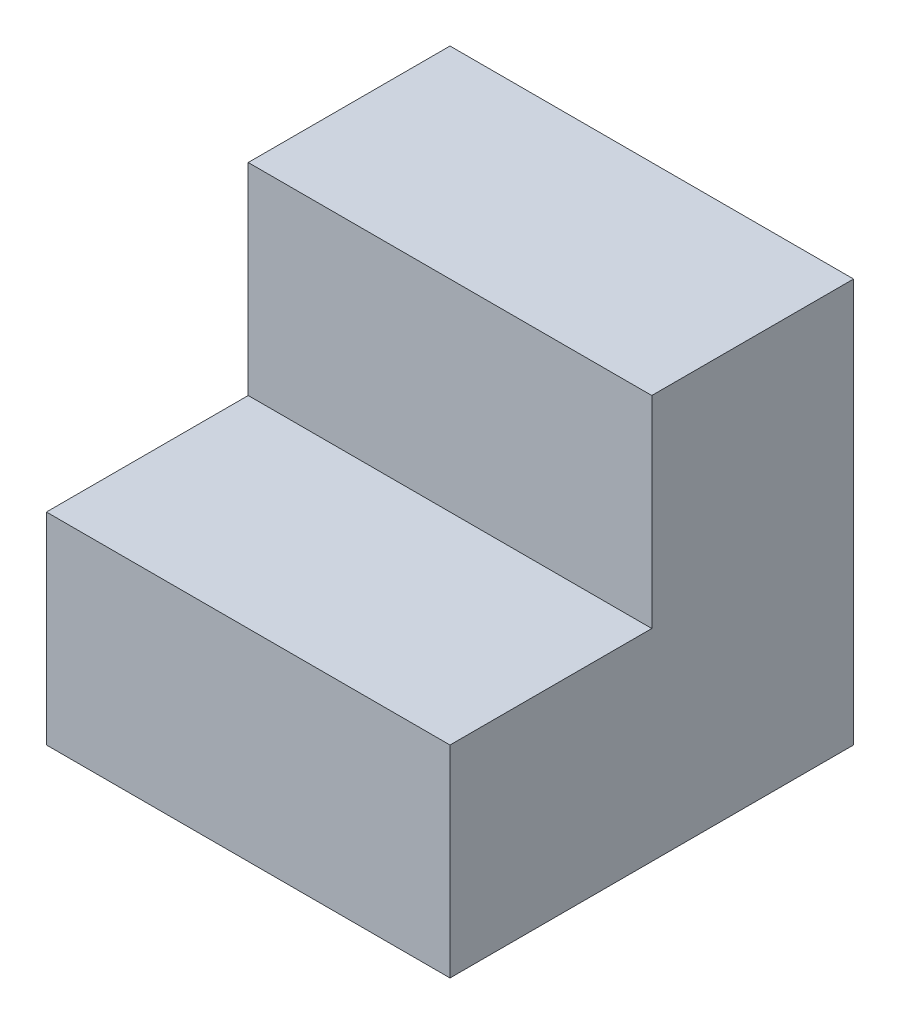
ISO-10303-21;
HEADER;
FILE_DESCRIPTION(('STEP AP214'),'2;1');
FILE_NAME('part.step','',(''),(''),'','','');
FILE_SCHEMA(('AUTOMOTIVE_DESIGN { 1 0 10303 214 1 1 1 1 }'));
ENDSEC;
DATA;
#1=APPLICATION_CONTEXT('core data for automotive mechanical design processes');
#2=APPLICATION_PROTOCOL_DEFINITION('international standard','automotive_design',2000,#1);
#3=PRODUCT_CONTEXT('',#1,'mechanical');
#4=PRODUCT('Part','Part','',(#3));
#5=PRODUCT_RELATED_PRODUCT_CATEGORY('part','',(#4));
#6=PRODUCT_DEFINITION_FORMATION('','',#4);
#7=PRODUCT_DEFINITION_CONTEXT('part definition',#1,'design');
#8=PRODUCT_DEFINITION('design','',#6,#7);
#9=PRODUCT_DEFINITION_SHAPE('','',#8);
#10=(LENGTH_UNIT() NAMED_UNIT(*) SI_UNIT(.MILLI.,.METRE.));
#11=(NAMED_UNIT(*) PLANE_ANGLE_UNIT() SI_UNIT($,.RADIAN.));
#12=(NAMED_UNIT(*) SI_UNIT($,.STERADIAN.) SOLID_ANGLE_UNIT());
#13=UNCERTAINTY_MEASURE_WITH_UNIT(LENGTH_MEASURE(1.E-05),#10,'distance_accuracy_value','');
#14=(GEOMETRIC_REPRESENTATION_CONTEXT(3) GLOBAL_UNCERTAINTY_ASSIGNED_CONTEXT((#13)) GLOBAL_UNIT_ASSIGNED_CONTEXT((#10,
#11,#12)) REPRESENTATION_CONTEXT('',''));
#15=CARTESIAN_POINT('',(0.,0.,0.));
#16=DIRECTION('',(0.,0.,1.));
#17=DIRECTION('',(1.,0.,0.));
#18=AXIS2_PLACEMENT_3D('',#15,#16,#17);
#19=CARTESIAN_POINT('',(15.,0.,0.));
#20=DIRECTION('',(0.,0.,1.));
#21=DIRECTION('',(1.,0.,0.));
#22=AXIS2_PLACEMENT_3D('',#19,#20,#21);
#23=PLANE('',#22);
#24=DIRECTION('',(0.,1.,0.));
#25=VECTOR('',#24,1.);
#26=CARTESIAN_POINT('',(-15.,0.,0.));
#27=LINE('',#26,#25);
#28=CARTESIAN_POINT('',(-15.,0.,0.));
#29=VERTEX_POINT('',#28);
#30=CARTESIAN_POINT('',(-15.,30.,0.));
#31=VERTEX_POINT('',#30);
#32=EDGE_CURVE('E128',#29,#31,#27,.T.);
#33=ORIENTED_EDGE('',*,*,#32,.T.);
#34=DIRECTION('',(-1.,0.,0.));
#35=VECTOR('',#34,1.);
#36=CARTESIAN_POINT('',(15.,30.,0.));
#37=LINE('',#36,#35);
#38=CARTESIAN_POINT('',(15.,30.,0.));
#39=VERTEX_POINT('',#38);
#40=EDGE_CURVE('E11',#39,#31,#37,.T.);
#41=ORIENTED_EDGE('',*,*,#40,.F.);
#42=DIRECTION('',(0.,1.,0.));
#43=VECTOR('',#42,1.);
#44=CARTESIAN_POINT('',(15.,0.,0.));
#45=LINE('',#44,#43);
#46=CARTESIAN_POINT('',(15.,0.,0.));
#47=VERTEX_POINT('',#46);
#48=EDGE_CURVE('E144',#47,#39,#45,.T.);
#49=ORIENTED_EDGE('',*,*,#48,.F.);
#50=DIRECTION('',(-1.,0.,0.));
#51=VECTOR('',#50,1.);
#52=CARTESIAN_POINT('',(15.,0.,0.));
#53=LINE('',#52,#51);
#54=EDGE_CURVE('E124',#47,#29,#53,.T.);
#55=ORIENTED_EDGE('',*,*,#54,.T.);
#56=EDGE_LOOP('',(#33,#41,#49,#55));
#57=FACE_BOUND('',#56,.T.);
#58=ADVANCED_FACE('F39',(#57),#23,.F.);
#59=CARTESIAN_POINT('',(15.,30.,0.));
#60=DIRECTION('',(0.,-1.,0.));
#61=DIRECTION('',(0.,0.,-1.));
#62=AXIS2_PLACEMENT_3D('',#59,#60,#61);
#63=PLANE('',#62);
#64=DIRECTION('',(0.,0.,1.));
#65=VECTOR('',#64,1.);
#66=CARTESIAN_POINT('',(-15.,30.,0.));
#67=LINE('',#66,#65);
#68=CARTESIAN_POINT('',(-15.,30.,15.));
#69=VERTEX_POINT('',#68);
#70=EDGE_CURVE('E132',#31,#69,#67,.T.);
#71=ORIENTED_EDGE('',*,*,#70,.T.);
#72=DIRECTION('',(-1.,0.,0.));
#73=VECTOR('',#72,1.);
#74=CARTESIAN_POINT('',(15.,30.,15.));
#75=LINE('',#74,#73);
#76=CARTESIAN_POINT('',(15.,30.,15.));
#77=VERTEX_POINT('',#76);
#78=EDGE_CURVE('E48',#77,#69,#75,.T.);
#79=ORIENTED_EDGE('',*,*,#78,.F.);
#80=DIRECTION('',(0.,0.,1.));
#81=VECTOR('',#80,1.);
#82=CARTESIAN_POINT('',(15.,30.,0.));
#83=LINE('',#82,#81);
#84=EDGE_CURVE('E93',#39,#77,#83,.T.);
#85=ORIENTED_EDGE('',*,*,#84,.F.);
#86=ORIENTED_EDGE('',*,*,#40,.T.);
#87=EDGE_LOOP('',(#71,#79,#85,#86));
#88=FACE_BOUND('',#87,.T.);
#89=ADVANCED_FACE('F172',(#88),#63,.F.);
#90=CARTESIAN_POINT('',(15.,15.,15.));
#91=DIRECTION('',(0.,0.,-1.));
#92=DIRECTION('',(0.,1.,0.));
#93=AXIS2_PLACEMENT_3D('',#90,#91,#92);
#94=PLANE('',#93);
#95=DIRECTION('',(0.,-1.,0.));
#96=VECTOR('',#95,1.);
#97=CARTESIAN_POINT('',(-15.,15.,15.));
#98=LINE('',#97,#96);
#99=CARTESIAN_POINT('',(-15.,15.,15.));
#100=VERTEX_POINT('',#99);
#101=EDGE_CURVE('E135',#69,#100,#98,.T.);
#102=ORIENTED_EDGE('',*,*,#101,.T.);
#103=DIRECTION('',(-1.,0.,0.));
#104=VECTOR('',#103,1.);
#105=CARTESIAN_POINT('',(15.,15.,15.));
#106=LINE('',#105,#104);
#107=CARTESIAN_POINT('',(15.,15.,15.));
#108=VERTEX_POINT('',#107);
#109=EDGE_CURVE('E117',#108,#100,#106,.T.);
#110=ORIENTED_EDGE('',*,*,#109,.F.);
#111=DIRECTION('',(0.,-1.,0.));
#112=VECTOR('',#111,1.);
#113=CARTESIAN_POINT('',(15.,15.,15.));
#114=LINE('',#113,#112);
#115=EDGE_CURVE('E106',#77,#108,#114,.T.);
#116=ORIENTED_EDGE('',*,*,#115,.F.);
#117=ORIENTED_EDGE('',*,*,#78,.T.);
#118=EDGE_LOOP('',(#102,#110,#116,#117));
#119=FACE_BOUND('',#118,.T.);
#120=ADVANCED_FACE('F154',(#119),#94,.F.);
#121=CARTESIAN_POINT('',(15.,15.,30.));
#122=DIRECTION('',(0.,-1.,0.));
#123=DIRECTION('',(0.,0.,-1.));
#124=AXIS2_PLACEMENT_3D('',#121,#122,#123);
#125=PLANE('',#124);
#126=DIRECTION('',(0.,0.,1.));
#127=VECTOR('',#126,1.);
#128=CARTESIAN_POINT('',(-15.,15.,30.));
#129=LINE('',#128,#127);
#130=CARTESIAN_POINT('',(-15.,15.,30.));
#131=VERTEX_POINT('',#130);
#132=EDGE_CURVE('E115',#100,#131,#129,.T.);
#133=ORIENTED_EDGE('',*,*,#132,.T.);
#134=DIRECTION('',(-1.,0.,0.));
#135=VECTOR('',#134,1.);
#136=CARTESIAN_POINT('',(15.,15.,30.));
#137=LINE('',#136,#135);
#138=CARTESIAN_POINT('',(15.,15.,30.));
#139=VERTEX_POINT('',#138);
#140=EDGE_CURVE('E112',#139,#131,#137,.T.);
#141=ORIENTED_EDGE('',*,*,#140,.F.);
#142=DIRECTION('',(0.,0.,1.));
#143=VECTOR('',#142,1.);
#144=CARTESIAN_POINT('',(15.,15.,30.));
#145=LINE('',#144,#143);
#146=EDGE_CURVE('E100',#108,#139,#145,.T.);
#147=ORIENTED_EDGE('',*,*,#146,.F.);
#148=ORIENTED_EDGE('',*,*,#109,.T.);
#149=EDGE_LOOP('',(#133,#141,#147,#148));
#150=FACE_BOUND('',#149,.T.);
#151=ADVANCED_FACE('F113',(#150),#125,.F.);
#152=CARTESIAN_POINT('',(15.,0.,30.));
#153=DIRECTION('',(0.,0.,-1.));
#154=DIRECTION('',(-1.,0.,0.));
#155=AXIS2_PLACEMENT_3D('',#152,#153,#154);
#156=PLANE('',#155);
#157=DIRECTION('',(0.,-1.,0.));
#158=VECTOR('',#157,1.);
#159=CARTESIAN_POINT('',(-15.,0.,30.));
#160=LINE('',#159,#158);
#161=CARTESIAN_POINT('',(-15.,0.,30.));
#162=VERTEX_POINT('',#161);
#163=EDGE_CURVE('E79',#131,#162,#160,.T.);
#164=ORIENTED_EDGE('',*,*,#163,.T.);
#165=DIRECTION('',(-1.,0.,0.));
#166=VECTOR('',#165,1.);
#167=CARTESIAN_POINT('',(15.,0.,30.));
#168=LINE('',#167,#166);
#169=CARTESIAN_POINT('',(15.,0.,30.));
#170=VERTEX_POINT('',#169);
#171=EDGE_CURVE('E118',#170,#162,#168,.T.);
#172=ORIENTED_EDGE('',*,*,#171,.F.);
#173=DIRECTION('',(0.,-1.,0.));
#174=VECTOR('',#173,1.);
#175=CARTESIAN_POINT('',(15.,0.,30.));
#176=LINE('',#175,#174);
#177=EDGE_CURVE('E104',#139,#170,#176,.T.);
#178=ORIENTED_EDGE('',*,*,#177,.F.);
#179=ORIENTED_EDGE('',*,*,#140,.T.);
#180=EDGE_LOOP('',(#164,#172,#178,#179));
#181=FACE_BOUND('',#180,.T.);
#182=ADVANCED_FACE('F120',(#181),#156,.F.);
#183=CARTESIAN_POINT('',(15.,0.,0.));
#184=DIRECTION('',(0.,1.,0.));
#185=DIRECTION('',(0.,0.,1.));
#186=AXIS2_PLACEMENT_3D('',#183,#184,#185);
#187=PLANE('',#186);
#188=DIRECTION('',(0.,0.,-1.));
#189=VECTOR('',#188,1.);
#190=CARTESIAN_POINT('',(-15.,0.,0.));
#191=LINE('',#190,#189);
#192=EDGE_CURVE('E85',#162,#29,#191,.T.);
#193=ORIENTED_EDGE('',*,*,#192,.T.);
#194=ORIENTED_EDGE('',*,*,#54,.F.);
#195=DIRECTION('',(0.,0.,-1.));
#196=VECTOR('',#195,1.);
#197=CARTESIAN_POINT('',(15.,0.,0.));
#198=LINE('',#197,#196);
#199=EDGE_CURVE('E56',#170,#47,#198,.T.);
#200=ORIENTED_EDGE('',*,*,#199,.F.);
#201=ORIENTED_EDGE('',*,*,#171,.T.);
#202=EDGE_LOOP('',(#193,#194,#200,#201));
#203=FACE_BOUND('',#202,.T.);
#204=ADVANCED_FACE('F161',(#203),#187,.F.);
#205=CARTESIAN_POINT('',(15.,0.,0.));
#206=DIRECTION('',(1.,0.,0.));
#207=DIRECTION('',(0.,0.,-1.));
#208=AXIS2_PLACEMENT_3D('',#205,#206,#207);
#209=PLANE('',#208);
#210=ORIENTED_EDGE('',*,*,#48,.T.);
#211=ORIENTED_EDGE('',*,*,#84,.T.);
#212=ORIENTED_EDGE('',*,*,#115,.T.);
#213=ORIENTED_EDGE('',*,*,#146,.T.);
#214=ORIENTED_EDGE('',*,*,#177,.T.);
#215=ORIENTED_EDGE('',*,*,#199,.T.);
#216=EDGE_LOOP('',(#210,#211,#212,#213,#214,#215));
#217=FACE_BOUND('',#216,.T.);
#218=ADVANCED_FACE('F102',(#217),#209,.T.);
#219=CARTESIAN_POINT('',(-15.,0.,0.));
#220=DIRECTION('',(1.,0.,0.));
#221=DIRECTION('',(0.,0.,-1.));
#222=AXIS2_PLACEMENT_3D('',#219,#220,#221);
#223=PLANE('',#222);
#224=ORIENTED_EDGE('',*,*,#32,.F.);
#225=ORIENTED_EDGE('',*,*,#192,.F.);
#226=ORIENTED_EDGE('',*,*,#163,.F.);
#227=ORIENTED_EDGE('',*,*,#132,.F.);
#228=ORIENTED_EDGE('',*,*,#101,.F.);
#229=ORIENTED_EDGE('',*,*,#70,.F.);
#230=EDGE_LOOP('',(#224,#225,#226,#227,#228,#229));
#231=FACE_BOUND('',#230,.T.);
#232=ADVANCED_FACE('F157',(#231),#223,.F.);
#233=CLOSED_SHELL('',(#58,#89,#120,#151,#182,#204,#218,#232));
#234=MANIFOLD_SOLID_BREP('B2',#233);
#235=ADVANCED_BREP_SHAPE_REPRESENTATION('',(#18,#234),#14);
#236=SHAPE_DEFINITION_REPRESENTATION(#9,#235);
ENDSEC;
END-ISO-10303-21;
